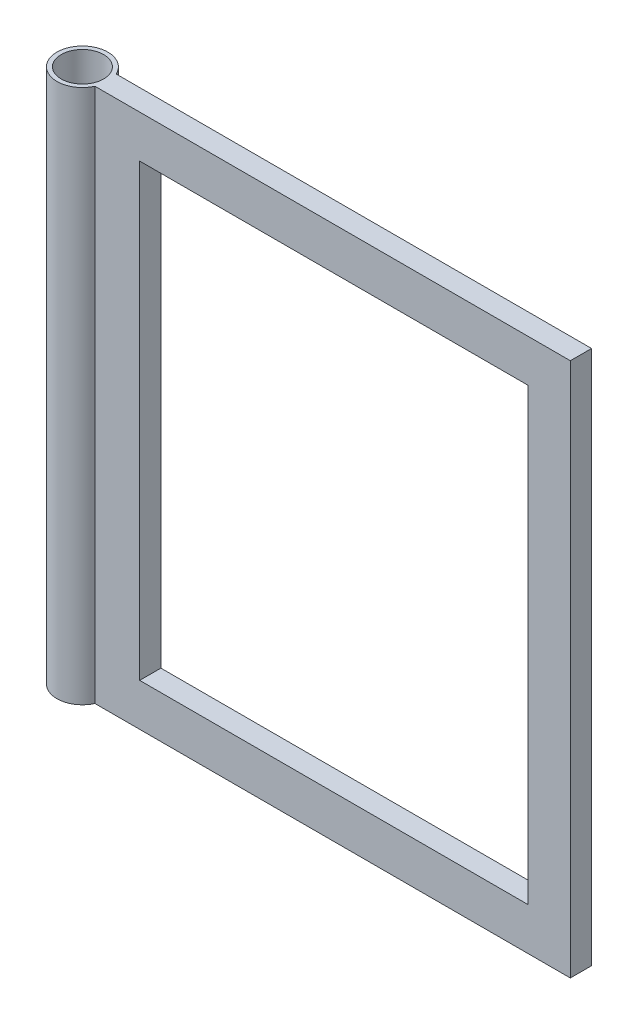
ISO-10303-21;
HEADER;
FILE_DESCRIPTION(('STEP AP214'),'2;1');
FILE_NAME('part.step','',(''),(''),'','','');
FILE_SCHEMA(('AUTOMOTIVE_DESIGN { 1 0 10303 214 1 1 1 1 }'));
ENDSEC;
DATA;
#1=APPLICATION_CONTEXT('core data for automotive mechanical design processes');
#2=APPLICATION_PROTOCOL_DEFINITION('international standard','automotive_design',2000,#1);
#3=PRODUCT_CONTEXT('',#1,'mechanical');
#4=PRODUCT('Part','Part','',(#3));
#5=PRODUCT_RELATED_PRODUCT_CATEGORY('part','',(#4));
#6=PRODUCT_DEFINITION_FORMATION('','',#4);
#7=PRODUCT_DEFINITION_CONTEXT('part definition',#1,'design');
#8=PRODUCT_DEFINITION('design','',#6,#7);
#9=PRODUCT_DEFINITION_SHAPE('','',#8);
#10=(LENGTH_UNIT() NAMED_UNIT(*) SI_UNIT(.MILLI.,.METRE.));
#11=(NAMED_UNIT(*) PLANE_ANGLE_UNIT() SI_UNIT($,.RADIAN.));
#12=(NAMED_UNIT(*) SI_UNIT($,.STERADIAN.) SOLID_ANGLE_UNIT());
#13=UNCERTAINTY_MEASURE_WITH_UNIT(LENGTH_MEASURE(1.E-05),#10,'distance_accuracy_value','');
#14=(GEOMETRIC_REPRESENTATION_CONTEXT(3) GLOBAL_UNCERTAINTY_ASSIGNED_CONTEXT((#13)) GLOBAL_UNIT_ASSIGNED_CONTEXT((#10,
#11,#12)) REPRESENTATION_CONTEXT('',''));
#15=CARTESIAN_POINT('',(0.,0.,0.));
#16=DIRECTION('',(0.,0.,1.));
#17=DIRECTION('',(1.,0.,0.));
#18=AXIS2_PLACEMENT_3D('',#15,#16,#17);
#19=CARTESIAN_POINT('',(0.,0.,0.));
#20=DIRECTION('',(0.,-1.,0.));
#21=DIRECTION('',(0.,0.,-1.));
#22=AXIS2_PLACEMENT_3D('',#19,#20,#21);
#23=CYLINDRICAL_SURFACE('',#22,60.);
#24=DIRECTION('',(0.,-1.,0.));
#25=VECTOR('',#24,1.);
#26=CARTESIAN_POINT('',(54.5435605731786,0.,25.));
#27=LINE('',#26,#25);
#28=CARTESIAN_POINT('',(54.5435605731786,0.,25.));
#29=VERTEX_POINT('',#28);
#30=CARTESIAN_POINT('',(54.5435605731786,1260.,25.));
#31=VERTEX_POINT('',#30);
#32=EDGE_CURVE('E117',#29,#31,#27,.F.);
#33=ORIENTED_EDGE('',*,*,#32,.T.);
#34=CARTESIAN_POINT('',(0.,1260.,0.));
#35=DIRECTION('',(0.,-1.,0.));
#36=DIRECTION('',(0.,0.,-1.));
#37=AXIS2_PLACEMENT_3D('',#34,#35,#36);
#38=CIRCLE('',#37,60.0000000000001);
#39=CARTESIAN_POINT('',(54.5435605731786,1260.,-25.));
#40=VERTEX_POINT('',#39);
#41=EDGE_CURVE('E63',#31,#40,#38,.T.);
#42=ORIENTED_EDGE('',*,*,#41,.T.);
#43=DIRECTION('',(0.,-1.,0.));
#44=VECTOR('',#43,1.);
#45=CARTESIAN_POINT('',(54.5435605731786,0.,-25.));
#46=LINE('',#45,#44);
#47=CARTESIAN_POINT('',(54.5435605731786,0.,-25.));
#48=VERTEX_POINT('',#47);
#49=EDGE_CURVE('E137',#40,#48,#46,.T.);
#50=ORIENTED_EDGE('',*,*,#49,.T.);
#51=CARTESIAN_POINT('',(0.,0.,0.));
#52=DIRECTION('',(0.,-1.,0.));
#53=DIRECTION('',(0.,0.,-1.));
#54=AXIS2_PLACEMENT_3D('',#51,#52,#53);
#55=CIRCLE('',#54,60.);
#56=EDGE_CURVE('E71',#29,#48,#55,.T.);
#57=ORIENTED_EDGE('',*,*,#56,.F.);
#58=EDGE_LOOP('',(#33,#42,#50,#57));
#59=FACE_BOUND('',#58,.T.);
#60=ADVANCED_FACE('F48',(#59),#23,.T.);
#61=CARTESIAN_POINT('',(-60.,0.,0.));
#62=DIRECTION('',(0.,1.,0.));
#63=DIRECTION('',(0.,0.,1.));
#64=AXIS2_PLACEMENT_3D('',#61,#62,#63);
#65=PLANE('',#64);
#66=DIRECTION('',(1.,0.,0.));
#67=VECTOR('',#66,1.);
#68=CARTESIAN_POINT('',(1175.,0.,25.));
#69=LINE('',#68,#67);
#70=CARTESIAN_POINT('',(1175.,0.,25.));
#71=VERTEX_POINT('',#70);
#72=EDGE_CURVE('E146',#29,#71,#69,.T.);
#73=ORIENTED_EDGE('',*,*,#72,.F.);
#74=ORIENTED_EDGE('',*,*,#56,.T.);
#75=DIRECTION('',(1.,0.,0.));
#76=VECTOR('',#75,1.);
#77=CARTESIAN_POINT('',(-60.002,0.,-25.));
#78=LINE('',#77,#76);
#79=CARTESIAN_POINT('',(1175.,0.,-25.));
#80=VERTEX_POINT('',#79);
#81=EDGE_CURVE('E133',#48,#80,#78,.T.);
#82=ORIENTED_EDGE('',*,*,#81,.T.);
#83=DIRECTION('',(0.,0.,-1.));
#84=VECTOR('',#83,1.);
#85=CARTESIAN_POINT('',(1175.,0.,25.));
#86=LINE('',#85,#84);
#87=EDGE_CURVE('E140',#71,#80,#86,.T.);
#88=ORIENTED_EDGE('',*,*,#87,.F.);
#89=EDGE_LOOP('',(#73,#74,#82,#88));
#90=FACE_BOUND('',#89,.T.);
#91=CARTESIAN_POINT('',(0.,0.,0.));
#92=DIRECTION('',(0.,-1.,0.));
#93=DIRECTION('',(0.,0.,-1.));
#94=AXIS2_PLACEMENT_3D('',#91,#92,#93);
#95=CIRCLE('',#94,50.);
#96=CARTESIAN_POINT('',(0.,0.,-50.));
#97=VERTEX_POINT('',#96);
#98=EDGE_CURVE('E13',#97,#97,#95,.T.);
#99=ORIENTED_EDGE('',*,*,#98,.F.);
#100=EDGE_LOOP('',(#99));
#101=FACE_BOUND('',#100,.T.);
#102=ADVANCED_FACE('F50',(#90,#101),#65,.F.);
#103=CARTESIAN_POINT('',(0.,0.,0.));
#104=DIRECTION('',(0.,-1.,0.));
#105=DIRECTION('',(0.,0.,-1.));
#106=AXIS2_PLACEMENT_3D('',#103,#104,#105);
#107=CYLINDRICAL_SURFACE('',#106,50.);
#108=CARTESIAN_POINT('',(0.,1260.,0.));
#109=DIRECTION('',(0.,-1.,0.));
#110=DIRECTION('',(0.,0.,-1.));
#111=AXIS2_PLACEMENT_3D('',#108,#109,#110);
#112=CIRCLE('',#111,50.);
#113=CARTESIAN_POINT('',(0.,1260.,-50.));
#114=VERTEX_POINT('',#113);
#115=EDGE_CURVE('E56',#114,#114,#112,.T.);
#116=ORIENTED_EDGE('',*,*,#115,.F.);
#117=EDGE_LOOP('',(#116));
#118=FACE_BOUND('',#117,.T.);
#119=ORIENTED_EDGE('',*,*,#98,.T.);
#120=EDGE_LOOP('',(#119));
#121=FACE_BOUND('',#120,.T.);
#122=ADVANCED_FACE('F209',(#118,#121),#107,.F.);
#123=CARTESIAN_POINT('',(-50.,1260.,0.));
#124=DIRECTION('',(0.,-1.,0.));
#125=DIRECTION('',(0.,0.,-1.));
#126=AXIS2_PLACEMENT_3D('',#123,#124,#125);
#127=PLANE('',#126);
#128=ORIENTED_EDGE('',*,*,#41,.F.);
#129=DIRECTION('',(-1.,0.,0.));
#130=VECTOR('',#129,1.);
#131=CARTESIAN_POINT('',(60.,1260.,25.));
#132=LINE('',#131,#130);
#133=CARTESIAN_POINT('',(1175.,1260.,25.));
#134=VERTEX_POINT('',#133);
#135=EDGE_CURVE('E114',#134,#31,#132,.T.);
#136=ORIENTED_EDGE('',*,*,#135,.F.);
#137=DIRECTION('',(0.,0.,-1.));
#138=VECTOR('',#137,1.);
#139=CARTESIAN_POINT('',(1175.,1260.,25.));
#140=LINE('',#139,#138);
#141=CARTESIAN_POINT('',(1175.,1260.,-25.));
#142=VERTEX_POINT('',#141);
#143=EDGE_CURVE('E123',#134,#142,#140,.T.);
#144=ORIENTED_EDGE('',*,*,#143,.T.);
#145=DIRECTION('',(1.,0.,0.));
#146=VECTOR('',#145,1.);
#147=CARTESIAN_POINT('',(-60.002,1260.,-25.));
#148=LINE('',#147,#146);
#149=EDGE_CURVE('E130',#40,#142,#148,.T.);
#150=ORIENTED_EDGE('',*,*,#149,.F.);
#151=EDGE_LOOP('',(#128,#136,#144,#150));
#152=FACE_BOUND('',#151,.T.);
#153=ORIENTED_EDGE('',*,*,#115,.T.);
#154=EDGE_LOOP('',(#153));
#155=FACE_BOUND('',#154,.T.);
#156=ADVANCED_FACE('F128',(#152,#155),#127,.F.);
#157=CARTESIAN_POINT('',(-60.002,1260.,-25.));
#158=DIRECTION('',(0.,0.,1.));
#159=DIRECTION('',(1.,0.,0.));
#160=AXIS2_PLACEMENT_3D('',#157,#158,#159);
#161=PLANE('',#160);
#162=ORIENTED_EDGE('',*,*,#49,.F.);
#163=ORIENTED_EDGE('',*,*,#149,.T.);
#164=DIRECTION('',(0.,1.,0.));
#165=VECTOR('',#164,1.);
#166=CARTESIAN_POINT('',(1175.,1260.,-25.));
#167=LINE('',#166,#165);
#168=EDGE_CURVE('E144',#80,#142,#167,.T.);
#169=ORIENTED_EDGE('',*,*,#168,.F.);
#170=ORIENTED_EDGE('',*,*,#81,.F.);
#171=EDGE_LOOP('',(#162,#163,#169,#170));
#172=FACE_BOUND('',#171,.T.);
#173=DIRECTION('',(1.,0.,0.));
#174=VECTOR('',#173,1.);
#175=CARTESIAN_POINT('',(1075.,100.,-25.));
#176=LINE('',#175,#174);
#177=CARTESIAN_POINT('',(160.,100.,-25.));
#178=VERTEX_POINT('',#177);
#179=CARTESIAN_POINT('',(1075.,100.,-25.));
#180=VERTEX_POINT('',#179);
#181=EDGE_CURVE('E161',#178,#180,#176,.T.);
#182=ORIENTED_EDGE('',*,*,#181,.T.);
#183=DIRECTION('',(0.,1.,0.));
#184=VECTOR('',#183,1.);
#185=CARTESIAN_POINT('',(1075.,1160.,-25.));
#186=LINE('',#185,#184);
#187=CARTESIAN_POINT('',(1075.,1160.,-25.));
#188=VERTEX_POINT('',#187);
#189=EDGE_CURVE('E125',#180,#188,#186,.T.);
#190=ORIENTED_EDGE('',*,*,#189,.T.);
#191=DIRECTION('',(-1.,0.,0.));
#192=VECTOR('',#191,1.);
#193=CARTESIAN_POINT('',(160.,1160.,-25.));
#194=LINE('',#193,#192);
#195=CARTESIAN_POINT('',(160.,1160.,-25.));
#196=VERTEX_POINT('',#195);
#197=EDGE_CURVE('E168',#188,#196,#194,.T.);
#198=ORIENTED_EDGE('',*,*,#197,.T.);
#199=DIRECTION('',(0.,-1.,0.));
#200=VECTOR('',#199,1.);
#201=CARTESIAN_POINT('',(160.,100.,-25.));
#202=LINE('',#201,#200);
#203=EDGE_CURVE('E165',#196,#178,#202,.T.);
#204=ORIENTED_EDGE('',*,*,#203,.T.);
#205=EDGE_LOOP('',(#182,#190,#198,#204));
#206=FACE_BOUND('',#205,.T.);
#207=ADVANCED_FACE('F195',(#172,#206),#161,.F.);
#208=CARTESIAN_POINT('',(0.,0.,25.));
#209=DIRECTION('',(0.,0.,-1.));
#210=DIRECTION('',(-1.,0.,0.));
#211=AXIS2_PLACEMENT_3D('',#208,#209,#210);
#212=PLANE('',#211);
#213=ORIENTED_EDGE('',*,*,#135,.T.);
#214=ORIENTED_EDGE('',*,*,#32,.F.);
#215=ORIENTED_EDGE('',*,*,#72,.T.);
#216=DIRECTION('',(0.,1.,0.));
#217=VECTOR('',#216,1.);
#218=CARTESIAN_POINT('',(1175.,1260.,25.));
#219=LINE('',#218,#217);
#220=EDGE_CURVE('E119',#71,#134,#219,.T.);
#221=ORIENTED_EDGE('',*,*,#220,.T.);
#222=EDGE_LOOP('',(#213,#214,#215,#221));
#223=FACE_BOUND('',#222,.T.);
#224=DIRECTION('',(0.,1.,0.));
#225=VECTOR('',#224,1.);
#226=CARTESIAN_POINT('',(1075.,1160.,25.));
#227=LINE('',#226,#225);
#228=CARTESIAN_POINT('',(1075.,100.,25.));
#229=VERTEX_POINT('',#228);
#230=CARTESIAN_POINT('',(1075.,1160.,25.));
#231=VERTEX_POINT('',#230);
#232=EDGE_CURVE('E164',#229,#231,#227,.T.);
#233=ORIENTED_EDGE('',*,*,#232,.F.);
#234=DIRECTION('',(1.,0.,0.));
#235=VECTOR('',#234,1.);
#236=CARTESIAN_POINT('',(1075.,100.,25.));
#237=LINE('',#236,#235);
#238=CARTESIAN_POINT('',(160.,100.,25.));
#239=VERTEX_POINT('',#238);
#240=EDGE_CURVE('E160',#239,#229,#237,.T.);
#241=ORIENTED_EDGE('',*,*,#240,.F.);
#242=DIRECTION('',(0.,-1.,0.));
#243=VECTOR('',#242,1.);
#244=CARTESIAN_POINT('',(160.,100.,25.));
#245=LINE('',#244,#243);
#246=CARTESIAN_POINT('',(160.,1160.,25.));
#247=VERTEX_POINT('',#246);
#248=EDGE_CURVE('E174',#247,#239,#245,.T.);
#249=ORIENTED_EDGE('',*,*,#248,.F.);
#250=DIRECTION('',(-1.,0.,0.));
#251=VECTOR('',#250,1.);
#252=CARTESIAN_POINT('',(160.,1160.,25.));
#253=LINE('',#252,#251);
#254=EDGE_CURVE('E177',#231,#247,#253,.T.);
#255=ORIENTED_EDGE('',*,*,#254,.F.);
#256=EDGE_LOOP('',(#233,#241,#249,#255));
#257=FACE_BOUND('',#256,.T.);
#258=ADVANCED_FACE('F115',(#223,#257),#212,.F.);
#259=CARTESIAN_POINT('',(1175.,1260.,25.));
#260=DIRECTION('',(-1.,0.,0.));
#261=DIRECTION('',(0.,-1.,0.));
#262=AXIS2_PLACEMENT_3D('',#259,#260,#261);
#263=PLANE('',#262);
#264=ORIENTED_EDGE('',*,*,#168,.T.);
#265=ORIENTED_EDGE('',*,*,#143,.F.);
#266=ORIENTED_EDGE('',*,*,#220,.F.);
#267=ORIENTED_EDGE('',*,*,#87,.T.);
#268=EDGE_LOOP('',(#264,#265,#266,#267));
#269=FACE_BOUND('',#268,.T.);
#270=ADVANCED_FACE('F240',(#269),#263,.F.);
#271=CARTESIAN_POINT('',(1075.,1160.,25.));
#272=DIRECTION('',(-1.,0.,0.));
#273=DIRECTION('',(0.,0.,1.));
#274=AXIS2_PLACEMENT_3D('',#271,#272,#273);
#275=PLANE('',#274);
#276=ORIENTED_EDGE('',*,*,#189,.F.);
#277=DIRECTION('',(0.,0.,-1.));
#278=VECTOR('',#277,1.);
#279=CARTESIAN_POINT('',(1075.,100.,25.));
#280=LINE('',#279,#278);
#281=EDGE_CURVE('E157',#229,#180,#280,.T.);
#282=ORIENTED_EDGE('',*,*,#281,.F.);
#283=ORIENTED_EDGE('',*,*,#232,.T.);
#284=DIRECTION('',(0.,0.,-1.));
#285=VECTOR('',#284,1.);
#286=CARTESIAN_POINT('',(1075.,1160.,25.));
#287=LINE('',#286,#285);
#288=EDGE_CURVE('E147',#231,#188,#287,.T.);
#289=ORIENTED_EDGE('',*,*,#288,.T.);
#290=EDGE_LOOP('',(#276,#282,#283,#289));
#291=FACE_BOUND('',#290,.T.);
#292=ADVANCED_FACE('F183',(#291),#275,.T.);
#293=CARTESIAN_POINT('',(160.,1160.,25.));
#294=DIRECTION('',(0.,-1.,0.));
#295=DIRECTION('',(0.,0.,-1.));
#296=AXIS2_PLACEMENT_3D('',#293,#294,#295);
#297=PLANE('',#296);
#298=ORIENTED_EDGE('',*,*,#197,.F.);
#299=ORIENTED_EDGE('',*,*,#288,.F.);
#300=ORIENTED_EDGE('',*,*,#254,.T.);
#301=DIRECTION('',(0.,0.,-1.));
#302=VECTOR('',#301,1.);
#303=CARTESIAN_POINT('',(160.,1160.,25.));
#304=LINE('',#303,#302);
#305=EDGE_CURVE('E153',#247,#196,#304,.T.);
#306=ORIENTED_EDGE('',*,*,#305,.T.);
#307=EDGE_LOOP('',(#298,#299,#300,#306));
#308=FACE_BOUND('',#307,.T.);
#309=ADVANCED_FACE('F187',(#308),#297,.T.);
#310=CARTESIAN_POINT('',(160.,100.,25.));
#311=DIRECTION('',(1.,0.,0.));
#312=DIRECTION('',(0.,0.,-1.));
#313=AXIS2_PLACEMENT_3D('',#310,#311,#312);
#314=PLANE('',#313);
#315=ORIENTED_EDGE('',*,*,#203,.F.);
#316=ORIENTED_EDGE('',*,*,#305,.F.);
#317=ORIENTED_EDGE('',*,*,#248,.T.);
#318=DIRECTION('',(0.,0.,-1.));
#319=VECTOR('',#318,1.);
#320=CARTESIAN_POINT('',(160.,100.,25.));
#321=LINE('',#320,#319);
#322=EDGE_CURVE('E155',#239,#178,#321,.T.);
#323=ORIENTED_EDGE('',*,*,#322,.T.);
#324=EDGE_LOOP('',(#315,#316,#317,#323));
#325=FACE_BOUND('',#324,.T.);
#326=ADVANCED_FACE('F192',(#325),#314,.T.);
#327=CARTESIAN_POINT('',(1075.,100.,25.));
#328=DIRECTION('',(0.,1.,0.));
#329=DIRECTION('',(0.,0.,1.));
#330=AXIS2_PLACEMENT_3D('',#327,#328,#329);
#331=PLANE('',#330);
#332=ORIENTED_EDGE('',*,*,#181,.F.);
#333=ORIENTED_EDGE('',*,*,#322,.F.);
#334=ORIENTED_EDGE('',*,*,#240,.T.);
#335=ORIENTED_EDGE('',*,*,#281,.T.);
#336=EDGE_LOOP('',(#332,#333,#334,#335));
#337=FACE_BOUND('',#336,.T.);
#338=ADVANCED_FACE('F197',(#337),#331,.T.);
#339=CLOSED_SHELL('',(#60,#102,#122,#156,#207,#258,#270,#292,#309,#326,#338));
#340=MANIFOLD_SOLID_BREP('B2',#339);
#341=ADVANCED_BREP_SHAPE_REPRESENTATION('',(#18,#340),#14);
#342=SHAPE_DEFINITION_REPRESENTATION(#9,#341);
ENDSEC;
END-ISO-10303-21;
